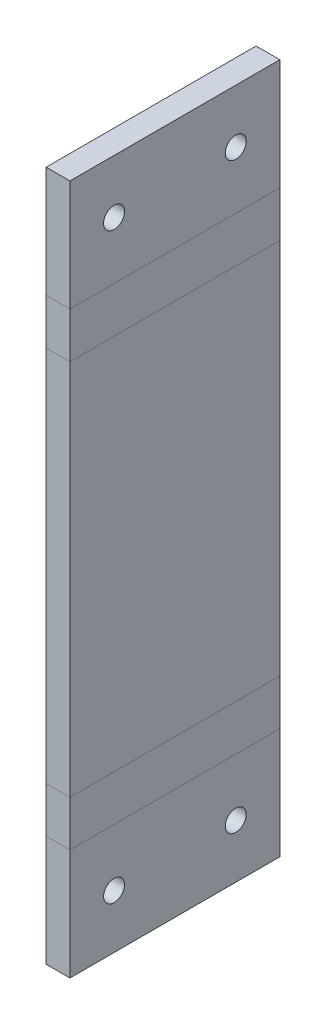
ISO-10303-21;
HEADER;
FILE_DESCRIPTION(('STEP AP214'),'2;1');
FILE_NAME('part.step','',(''),(''),'','','');
FILE_SCHEMA(('AUTOMOTIVE_DESIGN { 1 0 10303 214 1 1 1 1 }'));
ENDSEC;
DATA;
#1=APPLICATION_CONTEXT('core data for automotive mechanical design processes');
#2=APPLICATION_PROTOCOL_DEFINITION('international standard','automotive_design',2000,#1);
#3=PRODUCT_CONTEXT('',#1,'mechanical');
#4=PRODUCT('Part','Part','',(#3));
#5=PRODUCT_RELATED_PRODUCT_CATEGORY('part','',(#4));
#6=PRODUCT_DEFINITION_FORMATION('','',#4);
#7=PRODUCT_DEFINITION_CONTEXT('part definition',#1,'design');
#8=PRODUCT_DEFINITION('design','',#6,#7);
#9=PRODUCT_DEFINITION_SHAPE('','',#8);
#10=(LENGTH_UNIT() NAMED_UNIT(*) SI_UNIT(.MILLI.,.METRE.));
#11=(NAMED_UNIT(*) PLANE_ANGLE_UNIT() SI_UNIT($,.RADIAN.));
#12=(NAMED_UNIT(*) SI_UNIT($,.STERADIAN.) SOLID_ANGLE_UNIT());
#13=UNCERTAINTY_MEASURE_WITH_UNIT(LENGTH_MEASURE(1.E-05),#10,'distance_accuracy_value','');
#14=(GEOMETRIC_REPRESENTATION_CONTEXT(3) GLOBAL_UNCERTAINTY_ASSIGNED_CONTEXT((#13)) GLOBAL_UNIT_ASSIGNED_CONTEXT((#10,
#11,#12)) REPRESENTATION_CONTEXT('',''));
#15=CARTESIAN_POINT('',(0.,0.,0.));
#16=DIRECTION('',(0.,0.,1.));
#17=DIRECTION('',(1.,0.,0.));
#18=AXIS2_PLACEMENT_3D('',#15,#16,#17);
#19=CARTESIAN_POINT('',(-3.40000000000001,31.1,30.));
#20=DIRECTION('',(1.,0.,0.));
#21=DIRECTION('',(0.,1.,0.));
#22=AXIS2_PLACEMENT_3D('',#19,#20,#21);
#23=PLANE('',#22);
#24=DIRECTION('',(0.,0.,-1.));
#25=VECTOR('',#24,1.);
#26=CARTESIAN_POINT('',(-3.39999999999999,-26.95,30.));
#27=LINE('',#26,#25);
#28=CARTESIAN_POINT('',(-3.39999999999999,-26.95,30.));
#29=VERTEX_POINT('',#28);
#30=CARTESIAN_POINT('',(-3.39999999999999,-26.95,0.));
#31=VERTEX_POINT('',#30);
#32=EDGE_CURVE('E330',#29,#31,#27,.T.);
#33=ORIENTED_EDGE('',*,*,#32,.F.);
#34=DIRECTION('',(0.,-1.,0.));
#35=VECTOR('',#34,1.);
#36=CARTESIAN_POINT('',(-3.40000000000001,31.1,30.));
#37=LINE('',#36,#35);
#38=CARTESIAN_POINT('',(-3.40000000000001,26.95,30.));
#39=VERTEX_POINT('',#38);
#40=EDGE_CURVE('E97',#39,#29,#37,.T.);
#41=ORIENTED_EDGE('',*,*,#40,.F.);
#42=DIRECTION('',(0.,0.,1.));
#43=VECTOR('',#42,1.);
#44=CARTESIAN_POINT('',(-3.40000000000001,26.95,0.));
#45=LINE('',#44,#43);
#46=CARTESIAN_POINT('',(-3.40000000000001,26.95,0.));
#47=VERTEX_POINT('',#46);
#48=EDGE_CURVE('E90',#47,#39,#45,.T.);
#49=ORIENTED_EDGE('',*,*,#48,.F.);
#50=DIRECTION('',(0.,-1.,0.));
#51=VECTOR('',#50,1.);
#52=CARTESIAN_POINT('',(-3.40000000000001,31.1,0.));
#53=LINE('',#52,#51);
#54=EDGE_CURVE('E105',#47,#31,#53,.T.);
#55=ORIENTED_EDGE('',*,*,#54,.T.);
#56=EDGE_LOOP('',(#33,#41,#49,#55));
#57=FACE_BOUND('',#56,.T.);
#58=ADVANCED_FACE('F82',(#57),#23,.F.);
#59=CARTESIAN_POINT('',(0.,31.1,30.));
#60=DIRECTION('',(1.,0.,0.));
#61=DIRECTION('',(0.,1.,0.));
#62=AXIS2_PLACEMENT_3D('',#59,#60,#61);
#63=PLANE('',#62);
#64=DIRECTION('',(0.,-1.,0.));
#65=VECTOR('',#64,1.);
#66=CARTESIAN_POINT('',(0.,31.1,30.));
#67=LINE('',#66,#65);
#68=CARTESIAN_POINT('',(0.,26.95,30.));
#69=VERTEX_POINT('',#68);
#70=CARTESIAN_POINT('',(0.,-26.95,30.));
#71=VERTEX_POINT('',#70);
#72=EDGE_CURVE('E314',#69,#71,#67,.T.);
#73=ORIENTED_EDGE('',*,*,#72,.T.);
#74=DIRECTION('',(0.,0.,-1.));
#75=VECTOR('',#74,1.);
#76=CARTESIAN_POINT('',(0.,-26.95,30.));
#77=LINE('',#76,#75);
#78=CARTESIAN_POINT('',(0.,-26.95,0.));
#79=VERTEX_POINT('',#78);
#80=EDGE_CURVE('E318',#71,#79,#77,.T.);
#81=ORIENTED_EDGE('',*,*,#80,.T.);
#82=DIRECTION('',(0.,-1.,0.));
#83=VECTOR('',#82,1.);
#84=CARTESIAN_POINT('',(0.,31.1,0.));
#85=LINE('',#84,#83);
#86=CARTESIAN_POINT('',(0.,26.95,0.));
#87=VERTEX_POINT('',#86);
#88=EDGE_CURVE('E315',#87,#79,#85,.T.);
#89=ORIENTED_EDGE('',*,*,#88,.F.);
#90=DIRECTION('',(0.,0.,1.));
#91=VECTOR('',#90,1.);
#92=CARTESIAN_POINT('',(0.,26.95,0.));
#93=LINE('',#92,#91);
#94=EDGE_CURVE('E338',#87,#69,#93,.T.);
#95=ORIENTED_EDGE('',*,*,#94,.T.);
#96=EDGE_LOOP('',(#73,#81,#89,#95));
#97=FACE_BOUND('',#96,.T.);
#98=ADVANCED_FACE('F387',(#97),#63,.T.);
#99=CARTESIAN_POINT('',(0.,0.,30.));
#100=DIRECTION('',(0.,0.,-1.));
#101=DIRECTION('',(-1.,0.,0.));
#102=AXIS2_PLACEMENT_3D('',#99,#100,#101);
#103=PLANE('',#102);
#104=DIRECTION('',(1.,0.,0.));
#105=VECTOR('',#104,1.);
#106=CARTESIAN_POINT('',(-3.39999999999999,-26.95,30.));
#107=LINE('',#106,#105);
#108=EDGE_CURVE('E326',#29,#71,#107,.T.);
#109=ORIENTED_EDGE('',*,*,#108,.T.);
#110=ORIENTED_EDGE('',*,*,#72,.F.);
#111=DIRECTION('',(1.,0.,0.));
#112=VECTOR('',#111,1.);
#113=CARTESIAN_POINT('',(-3.40000000000001,26.95,30.));
#114=LINE('',#113,#112);
#115=EDGE_CURVE('E13',#39,#69,#114,.T.);
#116=ORIENTED_EDGE('',*,*,#115,.F.);
#117=ORIENTED_EDGE('',*,*,#40,.T.);
#118=EDGE_LOOP('',(#109,#110,#116,#117));
#119=FACE_BOUND('',#118,.T.);
#120=ADVANCED_FACE('F392',(#119),#103,.F.);
#121=CARTESIAN_POINT('',(0.,0.,0.));
#122=DIRECTION('',(0.,0.,-1.));
#123=DIRECTION('',(-1.,0.,0.));
#124=AXIS2_PLACEMENT_3D('',#121,#122,#123);
#125=PLANE('',#124);
#126=DIRECTION('',(1.,0.,0.));
#127=VECTOR('',#126,1.);
#128=CARTESIAN_POINT('',(-3.39999999999999,-26.95,0.));
#129=LINE('',#128,#127);
#130=EDGE_CURVE('E334',#31,#79,#129,.T.);
#131=ORIENTED_EDGE('',*,*,#130,.F.);
#132=ORIENTED_EDGE('',*,*,#54,.F.);
#133=DIRECTION('',(1.,0.,0.));
#134=VECTOR('',#133,1.);
#135=CARTESIAN_POINT('',(-3.40000000000001,26.95,0.));
#136=LINE('',#135,#134);
#137=EDGE_CURVE('E342',#47,#87,#136,.T.);
#138=ORIENTED_EDGE('',*,*,#137,.T.);
#139=ORIENTED_EDGE('',*,*,#88,.T.);
#140=EDGE_LOOP('',(#131,#132,#138,#139));
#141=FACE_BOUND('',#140,.T.);
#142=ADVANCED_FACE('F389',(#141),#125,.T.);
#143=CARTESIAN_POINT('',(0.,-33.4688047561988,30.));
#144=DIRECTION('',(0.,0.,1.));
#145=DIRECTION('',(0.,-1.,0.));
#146=AXIS2_PLACEMENT_3D('',#143,#144,#145);
#147=PLANE('',#146);
#148=ORIENTED_EDGE('',*,*,#108,.F.);
#149=DIRECTION('',(0.,1.,0.));
#150=VECTOR('',#149,1.);
#151=CARTESIAN_POINT('',(-3.39999999999999,-30.2094023780994,30.));
#152=LINE('',#151,#150);
#153=CARTESIAN_POINT('',(-3.39999999999998,-33.4688047561989,30.));
#154=VERTEX_POINT('',#153);
#155=EDGE_CURVE('E242',#29,#154,#152,.F.);
#156=ORIENTED_EDGE('',*,*,#155,.T.);
#157=DIRECTION('',(1.,0.,0.));
#158=VECTOR('',#157,1.);
#159=CARTESIAN_POINT('',(-3.39999999999998,-33.4688047561989,30.));
#160=LINE('',#159,#158);
#161=CARTESIAN_POINT('',(0.,-33.4688047561988,30.));
#162=VERTEX_POINT('',#161);
#163=EDGE_CURVE('E286',#154,#162,#160,.T.);
#164=ORIENTED_EDGE('',*,*,#163,.T.);
#165=DIRECTION('',(0.,-1.,0.));
#166=VECTOR('',#165,1.);
#167=CARTESIAN_POINT('',(0.,-33.4688047561988,30.));
#168=LINE('',#167,#166);
#169=EDGE_CURVE('E297',#71,#162,#168,.T.);
#170=ORIENTED_EDGE('',*,*,#169,.F.);
#171=EDGE_LOOP('',(#148,#156,#164,#170));
#172=FACE_BOUND('',#171,.T.);
#173=ADVANCED_FACE('F391',(#172),#147,.T.);
#174=CARTESIAN_POINT('',(0.,-26.95,0.));
#175=DIRECTION('',(0.,0.,-1.));
#176=DIRECTION('',(0.,1.,0.));
#177=AXIS2_PLACEMENT_3D('',#174,#175,#176);
#178=PLANE('',#177);
#179=DIRECTION('',(0.,1.,0.));
#180=VECTOR('',#179,1.);
#181=CARTESIAN_POINT('',(-3.39999999999999,-30.2094023780994,0.));
#182=LINE('',#181,#180);
#183=CARTESIAN_POINT('',(-3.39999999999998,-33.4688047561989,0.));
#184=VERTEX_POINT('',#183);
#185=EDGE_CURVE('E302',#184,#31,#182,.T.);
#186=ORIENTED_EDGE('',*,*,#185,.T.);
#187=ORIENTED_EDGE('',*,*,#130,.T.);
#188=DIRECTION('',(0.,1.,0.));
#189=VECTOR('',#188,1.);
#190=CARTESIAN_POINT('',(0.,-26.95,0.));
#191=LINE('',#190,#189);
#192=CARTESIAN_POINT('',(0.,-33.4688047561988,0.));
#193=VERTEX_POINT('',#192);
#194=EDGE_CURVE('E301',#193,#79,#191,.T.);
#195=ORIENTED_EDGE('',*,*,#194,.F.);
#196=DIRECTION('',(1.,0.,0.));
#197=VECTOR('',#196,1.);
#198=CARTESIAN_POINT('',(0.,-33.4688047561988,0.));
#199=LINE('',#198,#197);
#200=EDGE_CURVE('E247',#184,#193,#199,.T.);
#201=ORIENTED_EDGE('',*,*,#200,.F.);
#202=EDGE_LOOP('',(#186,#187,#195,#201));
#203=FACE_BOUND('',#202,.T.);
#204=ADVANCED_FACE('F399',(#203),#178,.T.);
#205=CARTESIAN_POINT('',(0.,-30.2094023780994,15.));
#206=DIRECTION('',(1.,0.,0.));
#207=DIRECTION('',(0.,1.,0.));
#208=AXIS2_PLACEMENT_3D('',#205,#206,#207);
#209=PLANE('',#208);
#210=DIRECTION('',(0.,0.,-1.));
#211=VECTOR('',#210,1.);
#212=CARTESIAN_POINT('',(0.,-33.4688047561988,0.));
#213=LINE('',#212,#211);
#214=EDGE_CURVE('E231',#162,#193,#213,.T.);
#215=ORIENTED_EDGE('',*,*,#214,.T.);
#216=ORIENTED_EDGE('',*,*,#194,.T.);
#217=ORIENTED_EDGE('',*,*,#80,.F.);
#218=ORIENTED_EDGE('',*,*,#169,.T.);
#219=EDGE_LOOP('',(#215,#216,#217,#218));
#220=FACE_BOUND('',#219,.T.);
#221=ADVANCED_FACE('F434',(#220),#209,.T.);
#222=CARTESIAN_POINT('',(-3.39999999999999,-30.2094023780994,15.));
#223=DIRECTION('',(1.,0.,0.));
#224=DIRECTION('',(0.,1.,0.));
#225=AXIS2_PLACEMENT_3D('',#222,#223,#224);
#226=PLANE('',#225);
#227=DIRECTION('',(0.,0.,1.));
#228=VECTOR('',#227,1.);
#229=CARTESIAN_POINT('',(-3.39999999999998,-33.4688047561989,0.));
#230=LINE('',#229,#228);
#231=EDGE_CURVE('E290',#184,#154,#230,.T.);
#232=ORIENTED_EDGE('',*,*,#231,.T.);
#233=ORIENTED_EDGE('',*,*,#155,.F.);
#234=ORIENTED_EDGE('',*,*,#32,.T.);
#235=ORIENTED_EDGE('',*,*,#185,.F.);
#236=EDGE_LOOP('',(#232,#233,#234,#235));
#237=FACE_BOUND('',#236,.T.);
#238=ADVANCED_FACE('F413',(#237),#226,.F.);
#239=CARTESIAN_POINT('',(1.31838984174237E-13,-41.6481761621217,23.6933324366016));
#240=DIRECTION('',(-1.,0.,0.));
#241=DIRECTION('',(0.,-1.,0.));
#242=AXIS2_PLACEMENT_3D('',#239,#240,#241);
#243=CYLINDRICAL_SURFACE('',#242,1.49999999999998);
#244=CARTESIAN_POINT('',(-3.39999999999993,-41.6481761621217,23.6933324366016));
#245=DIRECTION('',(-1.,0.,0.));
#246=DIRECTION('',(0.,-1.,0.));
#247=AXIS2_PLACEMENT_3D('',#244,#245,#246);
#248=CIRCLE('',#247,1.49999999999998);
#249=CARTESIAN_POINT('',(-3.39999999999992,-43.1481761621217,23.6933324366016));
#250=VERTEX_POINT('',#249);
#251=EDGE_CURVE('E282',#250,#250,#248,.T.);
#252=ORIENTED_EDGE('',*,*,#251,.T.);
#253=EDGE_LOOP('',(#252));
#254=FACE_BOUND('',#253,.T.);
#255=CARTESIAN_POINT('',(1.31838984174237E-13,-41.6481761621217,23.6933324366016));
#256=DIRECTION('',(-1.,0.,0.));
#257=DIRECTION('',(0.,-1.,0.));
#258=AXIS2_PLACEMENT_3D('',#255,#256,#257);
#259=CIRCLE('',#258,1.49999999999998);
#260=CARTESIAN_POINT('',(1.32091019970411E-13,-43.1481761621217,23.6933324366016));
#261=VERTEX_POINT('',#260);
#262=EDGE_CURVE('E257',#261,#261,#259,.T.);
#263=ORIENTED_EDGE('',*,*,#262,.F.);
#264=EDGE_LOOP('',(#263));
#265=FACE_BOUND('',#264,.T.);
#266=ADVANCED_FACE('F441',(#254,#265),#243,.F.);
#267=CARTESIAN_POINT('',(1.31838984174237E-13,-41.6481761621217,6.30666756339837));
#268=DIRECTION('',(-1.,0.,0.));
#269=DIRECTION('',(0.,-1.,0.));
#270=AXIS2_PLACEMENT_3D('',#267,#268,#269);
#271=CYLINDRICAL_SURFACE('',#270,1.5);
#272=CARTESIAN_POINT('',(-3.39999999999993,-41.6481761621217,6.30666756339837));
#273=DIRECTION('',(-1.,0.,0.));
#274=DIRECTION('',(0.,-1.,0.));
#275=AXIS2_PLACEMENT_3D('',#272,#273,#274);
#276=CIRCLE('',#275,1.5);
#277=CARTESIAN_POINT('',(-3.39999999999992,-43.1481761621217,6.30666756339837));
#278=VERTEX_POINT('',#277);
#279=EDGE_CURVE('E250',#278,#278,#276,.F.);
#280=ORIENTED_EDGE('',*,*,#279,.F.);
#281=EDGE_LOOP('',(#280));
#282=FACE_BOUND('',#281,.T.);
#283=CARTESIAN_POINT('',(1.31838984174237E-13,-41.6481761621217,6.30666756339837));
#284=DIRECTION('',(-1.,0.,0.));
#285=DIRECTION('',(0.,-1.,0.));
#286=AXIS2_PLACEMENT_3D('',#283,#284,#285);
#287=CIRCLE('',#286,1.5);
#288=CARTESIAN_POINT('',(1.32091019970411E-13,-43.1481761621217,6.30666756339837));
#289=VERTEX_POINT('',#288);
#290=EDGE_CURVE('E278',#289,#289,#287,.F.);
#291=ORIENTED_EDGE('',*,*,#290,.T.);
#292=EDGE_LOOP('',(#291));
#293=FACE_BOUND('',#292,.T.);
#294=ADVANCED_FACE('F459',(#282,#293),#271,.F.);
#295=CARTESIAN_POINT('',(1.31838984174237E-13,-49.3188047561989,0.));
#296=DIRECTION('',(0.,1.,0.));
#297=DIRECTION('',(-1.,0.,0.));
#298=AXIS2_PLACEMENT_3D('',#295,#296,#297);
#299=PLANE('',#298);
#300=DIRECTION('',(0.,0.,1.));
#301=VECTOR('',#300,1.);
#302=CARTESIAN_POINT('',(-3.39999999999987,-49.3188047561989,0.));
#303=LINE('',#302,#301);
#304=CARTESIAN_POINT('',(-3.39999999999987,-49.3188047561989,30.));
#305=VERTEX_POINT('',#304);
#306=CARTESIAN_POINT('',(-3.39999999999987,-49.3188047561989,0.));
#307=VERTEX_POINT('',#306);
#308=EDGE_CURVE('E275',#305,#307,#303,.F.);
#309=ORIENTED_EDGE('',*,*,#308,.T.);
#310=DIRECTION('',(-1.,0.,0.));
#311=VECTOR('',#310,1.);
#312=CARTESIAN_POINT('',(1.31838984174237E-13,-49.3188047561989,0.));
#313=LINE('',#312,#311);
#314=CARTESIAN_POINT('',(1.31838984174237E-13,-49.3188047561989,0.));
#315=VERTEX_POINT('',#314);
#316=EDGE_CURVE('E243',#315,#307,#313,.T.);
#317=ORIENTED_EDGE('',*,*,#316,.F.);
#318=DIRECTION('',(0.,0.,-1.));
#319=VECTOR('',#318,1.);
#320=CARTESIAN_POINT('',(1.31838984174237E-13,-49.3188047561989,0.));
#321=LINE('',#320,#319);
#322=CARTESIAN_POINT('',(1.31838984174237E-13,-49.3188047561989,30.));
#323=VERTEX_POINT('',#322);
#324=EDGE_CURVE('E265',#323,#315,#321,.T.);
#325=ORIENTED_EDGE('',*,*,#324,.F.);
#326=DIRECTION('',(-1.,0.,0.));
#327=VECTOR('',#326,1.);
#328=CARTESIAN_POINT('',(1.31838984174237E-13,-49.3188047561989,30.));
#329=LINE('',#328,#327);
#330=EDGE_CURVE('E271',#323,#305,#329,.T.);
#331=ORIENTED_EDGE('',*,*,#330,.T.);
#332=EDGE_LOOP('',(#309,#317,#325,#331));
#333=FACE_BOUND('',#332,.T.);
#334=ADVANCED_FACE('F456',(#333),#299,.F.);
#335=CARTESIAN_POINT('',(0.,-29.3188047561987,0.));
#336=DIRECTION('',(-1.,0.,0.));
#337=DIRECTION('',(0.,-1.,0.));
#338=AXIS2_PLACEMENT_3D('',#335,#336,#337);
#339=PLANE('',#338);
#340=ORIENTED_EDGE('',*,*,#214,.F.);
#341=DIRECTION('',(0.,-1.,0.));
#342=VECTOR('',#341,1.);
#343=CARTESIAN_POINT('',(0.,-29.3188047561987,30.));
#344=LINE('',#343,#342);
#345=EDGE_CURVE('E268',#162,#323,#344,.T.);
#346=ORIENTED_EDGE('',*,*,#345,.T.);
#347=ORIENTED_EDGE('',*,*,#324,.T.);
#348=DIRECTION('',(0.,1.,0.));
#349=VECTOR('',#348,1.);
#350=CARTESIAN_POINT('',(0.,-29.3188047561987,0.));
#351=LINE('',#350,#349);
#352=EDGE_CURVE('E261',#315,#193,#351,.T.);
#353=ORIENTED_EDGE('',*,*,#352,.T.);
#354=EDGE_LOOP('',(#340,#346,#347,#353));
#355=FACE_BOUND('',#354,.T.);
#356=ORIENTED_EDGE('',*,*,#290,.F.);
#357=EDGE_LOOP('',(#356));
#358=FACE_BOUND('',#357,.T.);
#359=ORIENTED_EDGE('',*,*,#262,.T.);
#360=EDGE_LOOP('',(#359));
#361=FACE_BOUND('',#360,.T.);
#362=ADVANCED_FACE('F428',(#355,#358,#361),#339,.F.);
#363=CARTESIAN_POINT('',(1.31838984174237E-13,-49.3188047561989,30.));
#364=DIRECTION('',(0.,0.,-1.));
#365=DIRECTION('',(0.,-1.,0.));
#366=AXIS2_PLACEMENT_3D('',#363,#364,#365);
#367=PLANE('',#366);
#368=ORIENTED_EDGE('',*,*,#163,.F.);
#369=DIRECTION('',(0.,1.,0.));
#370=VECTOR('',#369,1.);
#371=CARTESIAN_POINT('',(-3.39999999999987,-49.3188047561989,30.));
#372=LINE('',#371,#370);
#373=EDGE_CURVE('E254',#154,#305,#372,.F.);
#374=ORIENTED_EDGE('',*,*,#373,.T.);
#375=ORIENTED_EDGE('',*,*,#330,.F.);
#376=ORIENTED_EDGE('',*,*,#345,.F.);
#377=EDGE_LOOP('',(#368,#374,#375,#376));
#378=FACE_BOUND('',#377,.T.);
#379=ADVANCED_FACE('F449',(#378),#367,.F.);
#380=CARTESIAN_POINT('',(-3.40000000000001,-29.3188047561988,0.));
#381=DIRECTION('',(-1.,0.,0.));
#382=DIRECTION('',(0.,-1.,0.));
#383=AXIS2_PLACEMENT_3D('',#380,#381,#382);
#384=PLANE('',#383);
#385=ORIENTED_EDGE('',*,*,#279,.T.);
#386=EDGE_LOOP('',(#385));
#387=FACE_BOUND('',#386,.T.);
#388=ORIENTED_EDGE('',*,*,#373,.F.);
#389=ORIENTED_EDGE('',*,*,#231,.F.);
#390=DIRECTION('',(0.,-1.,0.));
#391=VECTOR('',#390,1.);
#392=CARTESIAN_POINT('',(-3.39999999999999,-32.7188047561989,0.));
#393=LINE('',#392,#391);
#394=EDGE_CURVE('E239',#307,#184,#393,.F.);
#395=ORIENTED_EDGE('',*,*,#394,.F.);
#396=ORIENTED_EDGE('',*,*,#308,.F.);
#397=EDGE_LOOP('',(#388,#389,#395,#396));
#398=FACE_BOUND('',#397,.T.);
#399=ORIENTED_EDGE('',*,*,#251,.F.);
#400=EDGE_LOOP('',(#399));
#401=FACE_BOUND('',#400,.T.);
#402=ADVANCED_FACE('F418',(#387,#398,#401),#384,.T.);
#403=CARTESIAN_POINT('',(0.,-32.7188047561988,0.));
#404=DIRECTION('',(0.,0.,1.));
#405=DIRECTION('',(0.,1.,0.));
#406=AXIS2_PLACEMENT_3D('',#403,#404,#405);
#407=PLANE('',#406);
#408=ORIENTED_EDGE('',*,*,#200,.T.);
#409=ORIENTED_EDGE('',*,*,#352,.F.);
#410=ORIENTED_EDGE('',*,*,#316,.T.);
#411=ORIENTED_EDGE('',*,*,#394,.T.);
#412=EDGE_LOOP('',(#408,#409,#410,#411));
#413=FACE_BOUND('',#412,.T.);
#414=ADVANCED_FACE('F426',(#413),#407,.F.);
#415=CARTESIAN_POINT('',(0.,33.4688047561988,0.));
#416=DIRECTION('',(0.,0.,-1.));
#417=DIRECTION('',(0.,1.,0.));
#418=AXIS2_PLACEMENT_3D('',#415,#416,#417);
#419=PLANE('',#418);
#420=ORIENTED_EDGE('',*,*,#137,.F.);
#421=DIRECTION('',(0.,1.,0.));
#422=VECTOR('',#421,1.);
#423=CARTESIAN_POINT('',(-3.40000000000001,30.2094023780994,0.));
#424=LINE('',#423,#422);
#425=CARTESIAN_POINT('',(-3.40000000000001,33.4688047561989,0.));
#426=VERTEX_POINT('',#425);
#427=EDGE_CURVE('E232',#47,#426,#424,.T.);
#428=ORIENTED_EDGE('',*,*,#427,.T.);
#429=DIRECTION('',(1.,0.,0.));
#430=VECTOR('',#429,1.);
#431=CARTESIAN_POINT('',(-3.40000000000001,33.4688047561989,0.));
#432=LINE('',#431,#430);
#433=CARTESIAN_POINT('',(0.,33.4688047561988,0.));
#434=VERTEX_POINT('',#433);
#435=EDGE_CURVE('E179',#426,#434,#432,.T.);
#436=ORIENTED_EDGE('',*,*,#435,.T.);
#437=DIRECTION('',(0.,1.,0.));
#438=VECTOR('',#437,1.);
#439=CARTESIAN_POINT('',(0.,33.4688047561988,0.));
#440=LINE('',#439,#438);
#441=EDGE_CURVE('E222',#87,#434,#440,.T.);
#442=ORIENTED_EDGE('',*,*,#441,.F.);
#443=EDGE_LOOP('',(#420,#428,#436,#442));
#444=FACE_BOUND('',#443,.T.);
#445=ADVANCED_FACE('F382',(#444),#419,.T.);
#446=CARTESIAN_POINT('',(0.,26.95,30.));
#447=DIRECTION('',(0.,0.,1.));
#448=DIRECTION('',(0.,-1.,0.));
#449=AXIS2_PLACEMENT_3D('',#446,#447,#448);
#450=PLANE('',#449);
#451=DIRECTION('',(0.,1.,0.));
#452=VECTOR('',#451,1.);
#453=CARTESIAN_POINT('',(-3.40000000000001,30.2094023780994,30.));
#454=LINE('',#453,#452);
#455=CARTESIAN_POINT('',(-3.40000000000001,33.4688047561989,30.));
#456=VERTEX_POINT('',#455);
#457=EDGE_CURVE('E227',#456,#39,#454,.F.);
#458=ORIENTED_EDGE('',*,*,#457,.T.);
#459=ORIENTED_EDGE('',*,*,#115,.T.);
#460=DIRECTION('',(0.,-1.,0.));
#461=VECTOR('',#460,1.);
#462=CARTESIAN_POINT('',(0.,26.95,30.));
#463=LINE('',#462,#461);
#464=CARTESIAN_POINT('',(0.,33.4688047561988,30.));
#465=VERTEX_POINT('',#464);
#466=EDGE_CURVE('E226',#465,#69,#463,.T.);
#467=ORIENTED_EDGE('',*,*,#466,.F.);
#468=DIRECTION('',(1.,0.,0.));
#469=VECTOR('',#468,1.);
#470=CARTESIAN_POINT('',(0.,33.4688047561988,30.));
#471=LINE('',#470,#469);
#472=EDGE_CURVE('E355',#456,#465,#471,.T.);
#473=ORIENTED_EDGE('',*,*,#472,.F.);
#474=EDGE_LOOP('',(#458,#459,#467,#473));
#475=FACE_BOUND('',#474,.T.);
#476=ADVANCED_FACE('F353',(#475),#450,.T.);
#477=CARTESIAN_POINT('',(0.,30.2094023780994,15.));
#478=DIRECTION('',(1.,0.,0.));
#479=DIRECTION('',(0.,1.,0.));
#480=AXIS2_PLACEMENT_3D('',#477,#478,#479);
#481=PLANE('',#480);
#482=DIRECTION('',(0.,0.,1.));
#483=VECTOR('',#482,1.);
#484=CARTESIAN_POINT('',(0.,33.4688047561988,30.));
#485=LINE('',#484,#483);
#486=EDGE_CURVE('E218',#434,#465,#485,.T.);
#487=ORIENTED_EDGE('',*,*,#486,.T.);
#488=ORIENTED_EDGE('',*,*,#466,.T.);
#489=ORIENTED_EDGE('',*,*,#94,.F.);
#490=ORIENTED_EDGE('',*,*,#441,.T.);
#491=EDGE_LOOP('',(#487,#488,#489,#490));
#492=FACE_BOUND('',#491,.T.);
#493=ADVANCED_FACE('F385',(#492),#481,.T.);
#494=CARTESIAN_POINT('',(-3.40000000000001,30.2094023780994,15.));
#495=DIRECTION('',(1.,0.,0.));
#496=DIRECTION('',(0.,1.,0.));
#497=AXIS2_PLACEMENT_3D('',#494,#495,#496);
#498=PLANE('',#497);
#499=DIRECTION('',(0.,0.,-1.));
#500=VECTOR('',#499,1.);
#501=CARTESIAN_POINT('',(-3.40000000000001,33.4688047561989,30.));
#502=LINE('',#501,#500);
#503=EDGE_CURVE('E215',#456,#426,#502,.T.);
#504=ORIENTED_EDGE('',*,*,#503,.T.);
#505=ORIENTED_EDGE('',*,*,#427,.F.);
#506=ORIENTED_EDGE('',*,*,#48,.T.);
#507=ORIENTED_EDGE('',*,*,#457,.F.);
#508=EDGE_LOOP('',(#504,#505,#506,#507));
#509=FACE_BOUND('',#508,.T.);
#510=ADVANCED_FACE('F349',(#509),#498,.F.);
#511=CARTESIAN_POINT('',(-62.2000000000001,41.6481761621219,23.6933324366016));
#512=DIRECTION('',(1.,0.,0.));
#513=DIRECTION('',(0.,1.,0.));
#514=AXIS2_PLACEMENT_3D('',#511,#512,#513);
#515=CYLINDRICAL_SURFACE('',#514,1.49999999999998);
#516=CARTESIAN_POINT('',(-3.39999999999995,41.6481761621215,23.6933324366016));
#517=DIRECTION('',(-1.,0.,0.));
#518=DIRECTION('',(0.,-1.,0.));
#519=AXIS2_PLACEMENT_3D('',#516,#517,#518);
#520=CIRCLE('',#519,1.49999999999998);
#521=CARTESIAN_POINT('',(-3.39999999999996,40.1481761621215,23.6933324366016));
#522=VERTEX_POINT('',#521);
#523=EDGE_CURVE('E206',#522,#522,#520,.T.);
#524=ORIENTED_EDGE('',*,*,#523,.T.);
#525=EDGE_LOOP('',(#524));
#526=FACE_BOUND('',#525,.T.);
#527=CARTESIAN_POINT('',(0.,41.6481761621215,23.6933324366016));
#528=DIRECTION('',(1.,0.,0.));
#529=DIRECTION('',(0.,1.,0.));
#530=AXIS2_PLACEMENT_3D('',#527,#528,#529);
#531=CIRCLE('',#530,1.49999999999998);
#532=CARTESIAN_POINT('',(0.,43.1481761621215,23.6933324366016));
#533=VERTEX_POINT('',#532);
#534=EDGE_CURVE('E202',#533,#533,#531,.T.);
#535=ORIENTED_EDGE('',*,*,#534,.T.);
#536=EDGE_LOOP('',(#535));
#537=FACE_BOUND('',#536,.T.);
#538=ADVANCED_FACE('F473',(#526,#537),#515,.F.);
#539=CARTESIAN_POINT('',(-62.2000000000001,41.6481761621219,6.30666756339837));
#540=DIRECTION('',(1.,0.,0.));
#541=DIRECTION('',(0.,1.,0.));
#542=AXIS2_PLACEMENT_3D('',#539,#540,#541);
#543=CYLINDRICAL_SURFACE('',#542,1.5);
#544=CARTESIAN_POINT('',(-3.39999999999995,41.6481761621215,6.30666756339837));
#545=DIRECTION('',(-1.,0.,0.));
#546=DIRECTION('',(0.,-1.,0.));
#547=AXIS2_PLACEMENT_3D('',#544,#545,#546);
#548=CIRCLE('',#547,1.5);
#549=CARTESIAN_POINT('',(-3.39999999999996,40.1481761621215,6.30666756339837));
#550=VERTEX_POINT('',#549);
#551=EDGE_CURVE('E185',#550,#550,#548,.F.);
#552=ORIENTED_EDGE('',*,*,#551,.F.);
#553=EDGE_LOOP('',(#552));
#554=FACE_BOUND('',#553,.T.);
#555=CARTESIAN_POINT('',(0.,41.6481761621215,6.30666756339837));
#556=DIRECTION('',(1.,0.,0.));
#557=DIRECTION('',(0.,1.,0.));
#558=AXIS2_PLACEMENT_3D('',#555,#556,#557);
#559=CIRCLE('',#558,1.5);
#560=CARTESIAN_POINT('',(0.,43.1481761621215,6.30666756339837));
#561=VERTEX_POINT('',#560);
#562=EDGE_CURVE('E186',#561,#561,#559,.F.);
#563=ORIENTED_EDGE('',*,*,#562,.F.);
#564=EDGE_LOOP('',(#563));
#565=FACE_BOUND('',#564,.T.);
#566=ADVANCED_FACE('F488',(#554,#565),#543,.F.);
#567=CARTESIAN_POINT('',(0.,49.3188047561989,30.));
#568=DIRECTION('',(0.,-1.,0.));
#569=DIRECTION('',(1.,0.,0.));
#570=AXIS2_PLACEMENT_3D('',#567,#568,#569);
#571=PLANE('',#570);
#572=DIRECTION('',(0.,0.,-1.));
#573=VECTOR('',#572,1.);
#574=CARTESIAN_POINT('',(-3.3999999999999,49.3188047561989,30.));
#575=LINE('',#574,#573);
#576=CARTESIAN_POINT('',(-3.3999999999999,49.3188047561989,0.));
#577=VERTEX_POINT('',#576);
#578=CARTESIAN_POINT('',(-3.3999999999999,49.3188047561989,30.));
#579=VERTEX_POINT('',#578);
#580=EDGE_CURVE('E191',#577,#579,#575,.F.);
#581=ORIENTED_EDGE('',*,*,#580,.T.);
#582=DIRECTION('',(-1.,0.,0.));
#583=VECTOR('',#582,1.);
#584=CARTESIAN_POINT('',(0.,49.3188047561989,30.));
#585=LINE('',#584,#583);
#586=CARTESIAN_POINT('',(0.,49.3188047561989,30.));
#587=VERTEX_POINT('',#586);
#588=EDGE_CURVE('E360',#587,#579,#585,.T.);
#589=ORIENTED_EDGE('',*,*,#588,.F.);
#590=DIRECTION('',(0.,0.,1.));
#591=VECTOR('',#590,1.);
#592=CARTESIAN_POINT('',(0.,49.3188047561989,0.));
#593=LINE('',#592,#591);
#594=CARTESIAN_POINT('',(0.,49.3188047561989,0.));
#595=VERTEX_POINT('',#594);
#596=EDGE_CURVE('E193',#595,#587,#593,.T.);
#597=ORIENTED_EDGE('',*,*,#596,.F.);
#598=DIRECTION('',(-1.,0.,0.));
#599=VECTOR('',#598,1.);
#600=CARTESIAN_POINT('',(0.,49.3188047561989,0.));
#601=LINE('',#600,#599);
#602=EDGE_CURVE('E176',#595,#577,#601,.T.);
#603=ORIENTED_EDGE('',*,*,#602,.T.);
#604=EDGE_LOOP('',(#581,#589,#597,#603));
#605=FACE_BOUND('',#604,.T.);
#606=ADVANCED_FACE('F189',(#605),#571,.F.);
#607=CARTESIAN_POINT('',(0.,29.3188047561987,0.));
#608=DIRECTION('',(-1.,0.,0.));
#609=DIRECTION('',(0.,-1.,0.));
#610=AXIS2_PLACEMENT_3D('',#607,#608,#609);
#611=PLANE('',#610);
#612=ORIENTED_EDGE('',*,*,#486,.F.);
#613=DIRECTION('',(0.,1.,0.));
#614=VECTOR('',#613,1.);
#615=CARTESIAN_POINT('',(0.,29.3188047561987,0.));
#616=LINE('',#615,#614);
#617=EDGE_CURVE('E195',#434,#595,#616,.T.);
#618=ORIENTED_EDGE('',*,*,#617,.T.);
#619=ORIENTED_EDGE('',*,*,#596,.T.);
#620=DIRECTION('',(0.,-1.,0.));
#621=VECTOR('',#620,1.);
#622=CARTESIAN_POINT('',(0.,29.3188047561987,30.));
#623=LINE('',#622,#621);
#624=EDGE_CURVE('E372',#587,#465,#623,.T.);
#625=ORIENTED_EDGE('',*,*,#624,.T.);
#626=EDGE_LOOP('',(#612,#618,#619,#625));
#627=FACE_BOUND('',#626,.T.);
#628=ORIENTED_EDGE('',*,*,#562,.T.);
#629=EDGE_LOOP('',(#628));
#630=FACE_BOUND('',#629,.T.);
#631=ORIENTED_EDGE('',*,*,#534,.F.);
#632=EDGE_LOOP('',(#631));
#633=FACE_BOUND('',#632,.T.);
#634=ADVANCED_FACE('F378',(#627,#630,#633),#611,.F.);
#635=CARTESIAN_POINT('',(0.,49.3188047561989,0.));
#636=DIRECTION('',(0.,0.,1.));
#637=DIRECTION('',(0.,-1.,0.));
#638=AXIS2_PLACEMENT_3D('',#635,#636,#637);
#639=PLANE('',#638);
#640=ORIENTED_EDGE('',*,*,#435,.F.);
#641=DIRECTION('',(0.,-1.,0.));
#642=VECTOR('',#641,1.);
#643=CARTESIAN_POINT('',(-3.3999999999999,49.3188047561989,0.));
#644=LINE('',#643,#642);
#645=EDGE_CURVE('E172',#426,#577,#644,.F.);
#646=ORIENTED_EDGE('',*,*,#645,.T.);
#647=ORIENTED_EDGE('',*,*,#602,.F.);
#648=ORIENTED_EDGE('',*,*,#617,.F.);
#649=EDGE_LOOP('',(#640,#646,#647,#648));
#650=FACE_BOUND('',#649,.T.);
#651=ADVANCED_FACE('F174',(#650),#639,.F.);
#652=CARTESIAN_POINT('',(-3.40000000000003,29.3188047561988,0.));
#653=DIRECTION('',(-1.,0.,0.));
#654=DIRECTION('',(0.,-1.,0.));
#655=AXIS2_PLACEMENT_3D('',#652,#653,#654);
#656=PLANE('',#655);
#657=ORIENTED_EDGE('',*,*,#551,.T.);
#658=EDGE_LOOP('',(#657));
#659=FACE_BOUND('',#658,.T.);
#660=ORIENTED_EDGE('',*,*,#645,.F.);
#661=ORIENTED_EDGE('',*,*,#503,.F.);
#662=DIRECTION('',(0.,1.,0.));
#663=VECTOR('',#662,1.);
#664=CARTESIAN_POINT('',(-3.40000000000001,32.7188047561989,30.));
#665=LINE('',#664,#663);
#666=EDGE_CURVE('E200',#579,#456,#665,.F.);
#667=ORIENTED_EDGE('',*,*,#666,.F.);
#668=ORIENTED_EDGE('',*,*,#580,.F.);
#669=EDGE_LOOP('',(#660,#661,#667,#668));
#670=FACE_BOUND('',#669,.T.);
#671=ORIENTED_EDGE('',*,*,#523,.F.);
#672=EDGE_LOOP('',(#671));
#673=FACE_BOUND('',#672,.T.);
#674=ADVANCED_FACE('F198',(#659,#670,#673),#656,.T.);
#675=CARTESIAN_POINT('',(0.,32.7188047561988,30.));
#676=DIRECTION('',(0.,0.,-1.));
#677=DIRECTION('',(0.,1.,0.));
#678=AXIS2_PLACEMENT_3D('',#675,#676,#677);
#679=PLANE('',#678);
#680=ORIENTED_EDGE('',*,*,#472,.T.);
#681=ORIENTED_EDGE('',*,*,#624,.F.);
#682=ORIENTED_EDGE('',*,*,#588,.T.);
#683=ORIENTED_EDGE('',*,*,#666,.T.);
#684=EDGE_LOOP('',(#680,#681,#682,#683));
#685=FACE_BOUND('',#684,.T.);
#686=ADVANCED_FACE('F476',(#685),#679,.F.);
#687=CLOSED_SHELL('',(#58,#98,#120,#142,#173,#204,#221,#238,#266,#294,#334,#362,#379,#402,#414,
#445,#476,#493,#510,#538,#566,#606,#634,#651,#674,#686));
#688=MANIFOLD_SOLID_BREP('B2',#687);
#689=ADVANCED_BREP_SHAPE_REPRESENTATION('',(#18,#688),#14);
#690=SHAPE_DEFINITION_REPRESENTATION(#9,#689);
ENDSEC;
END-ISO-10303-21;
